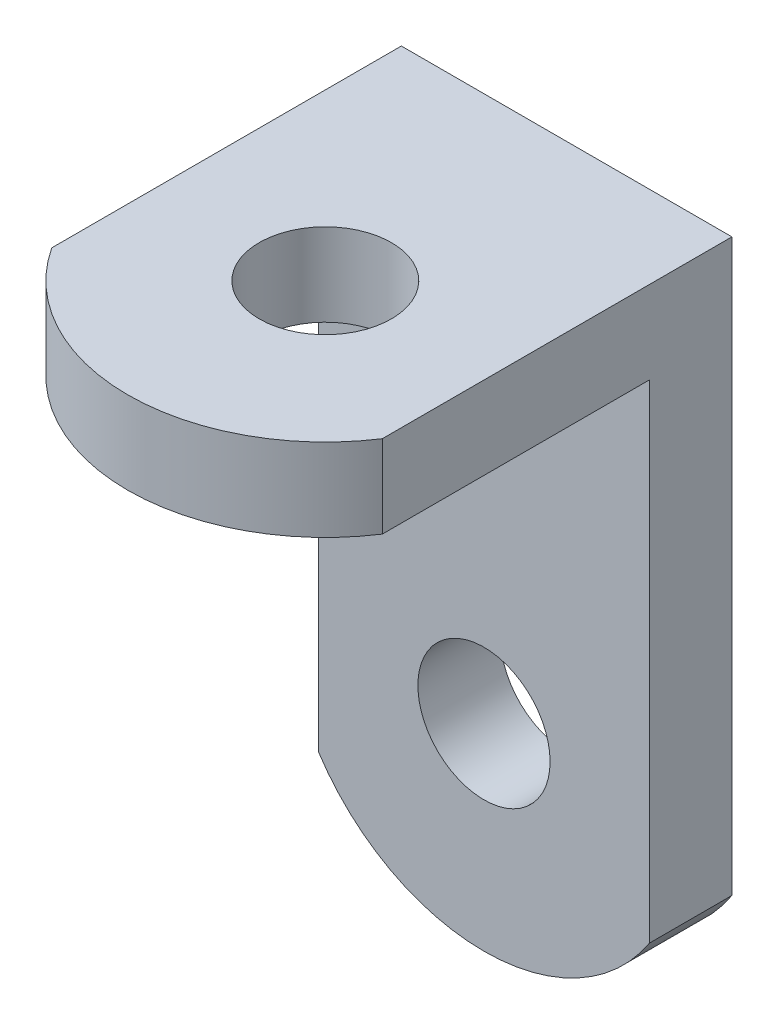
ISO-10303-21;
HEADER;
FILE_DESCRIPTION(('STEP AP214'),'2;1');
FILE_NAME('part.step','',(''),(''),'','','');
FILE_SCHEMA(('AUTOMOTIVE_DESIGN { 1 0 10303 214 1 1 1 1 }'));
ENDSEC;
DATA;
#1=APPLICATION_CONTEXT('core data for automotive mechanical design processes');
#2=APPLICATION_PROTOCOL_DEFINITION('international standard','automotive_design',2000,#1);
#3=PRODUCT_CONTEXT('',#1,'mechanical');
#4=PRODUCT('Part','Part','',(#3));
#5=PRODUCT_RELATED_PRODUCT_CATEGORY('part','',(#4));
#6=PRODUCT_DEFINITION_FORMATION('','',#4);
#7=PRODUCT_DEFINITION_CONTEXT('part definition',#1,'design');
#8=PRODUCT_DEFINITION('design','',#6,#7);
#9=PRODUCT_DEFINITION_SHAPE('','',#8);
#10=(LENGTH_UNIT() NAMED_UNIT(*) SI_UNIT(.MILLI.,.METRE.));
#11=(NAMED_UNIT(*) PLANE_ANGLE_UNIT() SI_UNIT($,.RADIAN.));
#12=(NAMED_UNIT(*) SI_UNIT($,.STERADIAN.) SOLID_ANGLE_UNIT());
#13=UNCERTAINTY_MEASURE_WITH_UNIT(LENGTH_MEASURE(1.E-05),#10,'distance_accuracy_value','');
#14=(GEOMETRIC_REPRESENTATION_CONTEXT(3) GLOBAL_UNCERTAINTY_ASSIGNED_CONTEXT((#13)) GLOBAL_UNIT_ASSIGNED_CONTEXT((#10,
#11,#12)) REPRESENTATION_CONTEXT('',''));
#15=CARTESIAN_POINT('',(0.,0.,0.));
#16=DIRECTION('',(0.,0.,1.));
#17=DIRECTION('',(1.,0.,0.));
#18=AXIS2_PLACEMENT_3D('',#15,#16,#17);
#19=CARTESIAN_POINT('',(-22.7772962881846,3.175,-14.8084731182796));
#20=DIRECTION('',(0.,0.,1.));
#21=DIRECTION('',(1.,0.,0.));
#22=AXIS2_PLACEMENT_3D('',#19,#20,#21);
#23=PLANE('',#22);
#24=CARTESIAN_POINT('',(-16.4272962881846,-14.605,-14.8084731182796));
#25=DIRECTION('',(0.,0.,1.));
#26=DIRECTION('',(1.,0.,0.));
#27=AXIS2_PLACEMENT_3D('',#24,#25,#26);
#28=CIRCLE('',#27,2.54);
#29=CARTESIAN_POINT('',(-13.8872962881846,-14.605,-14.8084731182796));
#30=VERTEX_POINT('',#29);
#31=EDGE_CURVE('E130',#30,#30,#28,.T.);
#32=ORIENTED_EDGE('',*,*,#31,.T.);
#33=EDGE_LOOP('',(#32));
#34=FACE_BOUND('',#33,.T.);
#35=DIRECTION('',(0.,-1.,0.));
#36=VECTOR('',#35,1.);
#37=CARTESIAN_POINT('',(-10.0772962881846,3.175,-14.8084731182796));
#38=LINE('',#37,#36);
#39=CARTESIAN_POINT('',(-10.0772962881846,3.175,-14.8084731182796));
#40=VERTEX_POINT('',#39);
#41=CARTESIAN_POINT('',(-10.0772962881846,-18.7399297242987,-14.8084731182796));
#42=VERTEX_POINT('',#41);
#43=EDGE_CURVE('E11',#40,#42,#38,.T.);
#44=ORIENTED_EDGE('',*,*,#43,.T.);
#45=CARTESIAN_POINT('',(-16.4272962881846,-14.605,-14.8084731182796));
#46=DIRECTION('',(0.,0.,-1.));
#47=DIRECTION('',(1.,0.,0.));
#48=AXIS2_PLACEMENT_3D('',#45,#46,#47);
#49=CIRCLE('',#48,7.57760805431959);
#50=CARTESIAN_POINT('',(-22.7772962881846,-18.7399297242987,-14.8084731182796));
#51=VERTEX_POINT('',#50);
#52=EDGE_CURVE('E138',#42,#51,#49,.T.);
#53=ORIENTED_EDGE('',*,*,#52,.T.);
#54=DIRECTION('',(0.,-1.,0.));
#55=VECTOR('',#54,1.);
#56=CARTESIAN_POINT('',(-22.7772962881846,3.175,-14.8084731182796));
#57=LINE('',#56,#55);
#58=CARTESIAN_POINT('',(-22.7772962881846,3.175,-14.8084731182796));
#59=VERTEX_POINT('',#58);
#60=EDGE_CURVE('E41',#59,#51,#57,.T.);
#61=ORIENTED_EDGE('',*,*,#60,.F.);
#62=DIRECTION('',(-1.,0.,0.));
#63=VECTOR('',#62,1.);
#64=CARTESIAN_POINT('',(-22.7772962881846,3.175,-14.8084731182796));
#65=LINE('',#64,#63);
#66=EDGE_CURVE('E106',#40,#59,#65,.T.);
#67=ORIENTED_EDGE('',*,*,#66,.F.);
#68=EDGE_LOOP('',(#44,#53,#61,#67));
#69=FACE_BOUND('',#68,.T.);
#70=ADVANCED_FACE('F33',(#34,#69),#23,.F.);
#71=CARTESIAN_POINT('',(-10.0772962881846,-22.225,-11.6334731182796));
#72=DIRECTION('',(0.,0.,-1.));
#73=DIRECTION('',(-1.,0.,0.));
#74=AXIS2_PLACEMENT_3D('',#71,#72,#73);
#75=PLANE('',#74);
#76=CARTESIAN_POINT('',(-16.4272962881846,-14.605,-11.6334731182796));
#77=DIRECTION('',(0.,0.,1.));
#78=DIRECTION('',(1.,0.,0.));
#79=AXIS2_PLACEMENT_3D('',#76,#77,#78);
#80=CIRCLE('',#79,2.54);
#81=CARTESIAN_POINT('',(-13.8872962881846,-14.605,-11.6334731182796));
#82=VERTEX_POINT('',#81);
#83=EDGE_CURVE('E131',#82,#82,#80,.T.);
#84=ORIENTED_EDGE('',*,*,#83,.F.);
#85=EDGE_LOOP('',(#84));
#86=FACE_BOUND('',#85,.T.);
#87=DIRECTION('',(0.,1.,0.));
#88=VECTOR('',#87,1.);
#89=CARTESIAN_POINT('',(-22.7772962881846,-22.225,-11.6334731182796));
#90=LINE('',#89,#88);
#91=CARTESIAN_POINT('',(-22.7772962881846,-18.7399297242987,-11.6334731182796));
#92=VERTEX_POINT('',#91);
#93=CARTESIAN_POINT('',(-22.7772962881846,0.,-11.6334731182796));
#94=VERTEX_POINT('',#93);
#95=EDGE_CURVE('E125',#92,#94,#90,.T.);
#96=ORIENTED_EDGE('',*,*,#95,.F.);
#97=CARTESIAN_POINT('',(-16.4272962881846,-14.605,-11.6334731182796));
#98=DIRECTION('',(0.,0.,-1.));
#99=DIRECTION('',(1.,0.,0.));
#100=AXIS2_PLACEMENT_3D('',#97,#98,#99);
#101=CIRCLE('',#100,7.57760805431959);
#102=CARTESIAN_POINT('',(-10.0772962881846,-18.7399297242987,-11.6334731182796));
#103=VERTEX_POINT('',#102);
#104=EDGE_CURVE('E101',#103,#92,#101,.T.);
#105=ORIENTED_EDGE('',*,*,#104,.F.);
#106=DIRECTION('',(0.,1.,0.));
#107=VECTOR('',#106,1.);
#108=CARTESIAN_POINT('',(-10.0772962881846,-22.225,-11.6334731182796));
#109=LINE('',#108,#107);
#110=CARTESIAN_POINT('',(-10.0772962881846,0.,-11.6334731182796));
#111=VERTEX_POINT('',#110);
#112=EDGE_CURVE('E120',#103,#111,#109,.T.);
#113=ORIENTED_EDGE('',*,*,#112,.T.);
#114=DIRECTION('',(-1.,0.,0.));
#115=VECTOR('',#114,1.);
#116=CARTESIAN_POINT('',(-10.0772962881846,0.,-11.6334731182796));
#117=LINE('',#116,#115);
#118=EDGE_CURVE('E127',#111,#94,#117,.T.);
#119=ORIENTED_EDGE('',*,*,#118,.T.);
#120=EDGE_LOOP('',(#96,#105,#113,#119));
#121=FACE_BOUND('',#120,.T.);
#122=ADVANCED_FACE('F154',(#86,#121),#75,.F.);
#123=CARTESIAN_POINT('',(0.,0.,0.));
#124=DIRECTION('',(0.,1.,0.));
#125=DIRECTION('',(0.,0.,1.));
#126=AXIS2_PLACEMENT_3D('',#123,#124,#125);
#127=PLANE('',#126);
#128=CARTESIAN_POINT('',(-16.4272962881846,0.,-5.53747311827957));
#129=DIRECTION('',(0.,1.,0.));
#130=DIRECTION('',(0.,0.,1.));
#131=AXIS2_PLACEMENT_3D('',#128,#129,#130);
#132=CIRCLE('',#131,2.54);
#133=CARTESIAN_POINT('',(-16.4272962881846,0.,-2.99747311827957));
#134=VERTEX_POINT('',#133);
#135=EDGE_CURVE('E115',#134,#134,#132,.T.);
#136=ORIENTED_EDGE('',*,*,#135,.T.);
#137=EDGE_LOOP('',(#136));
#138=FACE_BOUND('',#137,.T.);
#139=DIRECTION('',(0.,0.,-1.));
#140=VECTOR('',#139,1.);
#141=CARTESIAN_POINT('',(-10.0772962881846,0.,-14.8084731182796));
#142=LINE('',#141,#140);
#143=CARTESIAN_POINT('',(-10.0772962881846,0.,-1.37673749706527));
#144=VERTEX_POINT('',#143);
#145=EDGE_CURVE('E113',#144,#111,#142,.T.);
#146=ORIENTED_EDGE('',*,*,#145,.F.);
#147=CARTESIAN_POINT('',(-16.4272962881846,0.,-5.53747311827957));
#148=DIRECTION('',(0.,1.,0.));
#149=DIRECTION('',(0.,0.,-1.));
#150=AXIS2_PLACEMENT_3D('',#147,#148,#149);
#151=CIRCLE('',#150,7.591720550023);
#152=CARTESIAN_POINT('',(-22.7772962881846,0.,-1.37673749706526));
#153=VERTEX_POINT('',#152);
#154=EDGE_CURVE('E91',#153,#144,#151,.T.);
#155=ORIENTED_EDGE('',*,*,#154,.F.);
#156=DIRECTION('',(0.,0.,1.));
#157=VECTOR('',#156,1.);
#158=CARTESIAN_POINT('',(-22.7772962881846,0.,-14.8084731182796));
#159=LINE('',#158,#157);
#160=EDGE_CURVE('E100',#94,#153,#159,.T.);
#161=ORIENTED_EDGE('',*,*,#160,.F.);
#162=ORIENTED_EDGE('',*,*,#118,.F.);
#163=EDGE_LOOP('',(#146,#155,#161,#162));
#164=FACE_BOUND('',#163,.T.);
#165=ADVANCED_FACE('F151',(#138,#164),#127,.F.);
#166=CARTESIAN_POINT('',(-10.0772962881846,3.175,-14.8084731182796));
#167=DIRECTION('',(-1.,0.,0.));
#168=DIRECTION('',(0.,0.,1.));
#169=AXIS2_PLACEMENT_3D('',#166,#167,#168);
#170=PLANE('',#169);
#171=DIRECTION('',(0.,0.,-1.));
#172=VECTOR('',#171,1.);
#173=CARTESIAN_POINT('',(-10.0772962881846,3.175,-14.8084731182796));
#174=LINE('',#173,#172);
#175=CARTESIAN_POINT('',(-10.0772962881846,3.175,-1.37673749706527));
#176=VERTEX_POINT('',#175);
#177=EDGE_CURVE('E109',#176,#40,#174,.T.);
#178=ORIENTED_EDGE('',*,*,#177,.F.);
#179=DIRECTION('',(0.,-1.,0.));
#180=VECTOR('',#179,1.);
#181=CARTESIAN_POINT('',(-10.0772962881846,3.175,-1.37673749706527));
#182=LINE('',#181,#180);
#183=EDGE_CURVE('E48',#176,#144,#182,.T.);
#184=ORIENTED_EDGE('',*,*,#183,.T.);
#185=ORIENTED_EDGE('',*,*,#145,.T.);
#186=ORIENTED_EDGE('',*,*,#112,.F.);
#187=DIRECTION('',(0.,0.,1.));
#188=VECTOR('',#187,1.);
#189=CARTESIAN_POINT('',(-10.0772962881846,-18.7399297242987,-14.8084731182796));
#190=LINE('',#189,#188);
#191=EDGE_CURVE('E56',#42,#103,#190,.T.);
#192=ORIENTED_EDGE('',*,*,#191,.F.);
#193=ORIENTED_EDGE('',*,*,#43,.F.);
#194=EDGE_LOOP('',(#178,#184,#185,#186,#192,#193));
#195=FACE_BOUND('',#194,.T.);
#196=ADVANCED_FACE('F35',(#195),#170,.F.);
#197=CARTESIAN_POINT('',(-22.7772962881846,3.175,-14.8084731182796));
#198=DIRECTION('',(1.,0.,0.));
#199=DIRECTION('',(0.,0.,-1.));
#200=AXIS2_PLACEMENT_3D('',#197,#198,#199);
#201=PLANE('',#200);
#202=ORIENTED_EDGE('',*,*,#160,.T.);
#203=DIRECTION('',(0.,-1.,0.));
#204=VECTOR('',#203,1.);
#205=CARTESIAN_POINT('',(-22.7772962881846,3.175,-1.37673749706526));
#206=LINE('',#205,#204);
#207=CARTESIAN_POINT('',(-22.7772962881846,3.175,-1.37673749706526));
#208=VERTEX_POINT('',#207);
#209=EDGE_CURVE('E86',#208,#153,#206,.T.);
#210=ORIENTED_EDGE('',*,*,#209,.F.);
#211=DIRECTION('',(0.,0.,1.));
#212=VECTOR('',#211,1.);
#213=CARTESIAN_POINT('',(-22.7772962881846,3.175,-14.8084731182796));
#214=LINE('',#213,#212);
#215=EDGE_CURVE('E98',#59,#208,#214,.T.);
#216=ORIENTED_EDGE('',*,*,#215,.F.);
#217=ORIENTED_EDGE('',*,*,#60,.T.);
#218=DIRECTION('',(0.,0.,1.));
#219=VECTOR('',#218,1.);
#220=CARTESIAN_POINT('',(-22.7772962881846,-18.7399297242987,-14.8084731182796));
#221=LINE('',#220,#219);
#222=EDGE_CURVE('E134',#51,#92,#221,.T.);
#223=ORIENTED_EDGE('',*,*,#222,.T.);
#224=ORIENTED_EDGE('',*,*,#95,.T.);
#225=EDGE_LOOP('',(#202,#210,#216,#217,#223,#224));
#226=FACE_BOUND('',#225,.T.);
#227=ADVANCED_FACE('F96',(#226),#201,.F.);
#228=CARTESIAN_POINT('',(0.,3.175,0.));
#229=DIRECTION('',(0.,1.,0.));
#230=DIRECTION('',(0.,0.,1.));
#231=AXIS2_PLACEMENT_3D('',#228,#229,#230);
#232=PLANE('',#231);
#233=CARTESIAN_POINT('',(-16.4272962881846,3.175,-5.53747311827957));
#234=DIRECTION('',(0.,1.,0.));
#235=DIRECTION('',(0.,0.,-1.));
#236=AXIS2_PLACEMENT_3D('',#233,#234,#235);
#237=CIRCLE('',#236,7.591720550023);
#238=EDGE_CURVE('E83',#208,#176,#237,.T.);
#239=ORIENTED_EDGE('',*,*,#238,.T.);
#240=ORIENTED_EDGE('',*,*,#177,.T.);
#241=ORIENTED_EDGE('',*,*,#66,.T.);
#242=ORIENTED_EDGE('',*,*,#215,.T.);
#243=EDGE_LOOP('',(#239,#240,#241,#242));
#244=FACE_BOUND('',#243,.T.);
#245=CARTESIAN_POINT('',(-16.4272962881846,3.175,-5.53747311827957));
#246=DIRECTION('',(0.,1.,0.));
#247=DIRECTION('',(0.,0.,1.));
#248=AXIS2_PLACEMENT_3D('',#245,#246,#247);
#249=CIRCLE('',#248,2.54);
#250=CARTESIAN_POINT('',(-16.4272962881846,3.175,-2.99747311827957));
#251=VERTEX_POINT('',#250);
#252=EDGE_CURVE('E117',#251,#251,#249,.T.);
#253=ORIENTED_EDGE('',*,*,#252,.F.);
#254=EDGE_LOOP('',(#253));
#255=FACE_BOUND('',#254,.T.);
#256=ADVANCED_FACE('F103',(#244,#255),#232,.T.);
#257=CARTESIAN_POINT('',(-16.4272962881846,0.,-5.53747311827957));
#258=DIRECTION('',(0.,1.,0.));
#259=DIRECTION('',(0.,0.,1.));
#260=AXIS2_PLACEMENT_3D('',#257,#258,#259);
#261=CYLINDRICAL_SURFACE('',#260,2.54);
#262=ORIENTED_EDGE('',*,*,#135,.F.);
#263=EDGE_LOOP('',(#262));
#264=FACE_BOUND('',#263,.T.);
#265=ORIENTED_EDGE('',*,*,#252,.T.);
#266=EDGE_LOOP('',(#265));
#267=FACE_BOUND('',#266,.T.);
#268=ADVANCED_FACE('F165',(#264,#267),#261,.F.);
#269=CARTESIAN_POINT('',(-16.4272962881846,-14.605,-14.8084731182796));
#270=DIRECTION('',(0.,0.,1.));
#271=DIRECTION('',(1.,0.,0.));
#272=AXIS2_PLACEMENT_3D('',#269,#270,#271);
#273=CYLINDRICAL_SURFACE('',#272,2.54);
#274=ORIENTED_EDGE('',*,*,#31,.F.);
#275=EDGE_LOOP('',(#274));
#276=FACE_BOUND('',#275,.T.);
#277=ORIENTED_EDGE('',*,*,#83,.T.);
#278=EDGE_LOOP('',(#277));
#279=FACE_BOUND('',#278,.T.);
#280=ADVANCED_FACE('F158',(#276,#279),#273,.F.);
#281=CARTESIAN_POINT('',(-16.4272962881846,-14.605,-14.8084731182796));
#282=DIRECTION('',(0.,0.,1.));
#283=DIRECTION('',(1.,0.,0.));
#284=AXIS2_PLACEMENT_3D('',#281,#282,#283);
#285=CYLINDRICAL_SURFACE('',#284,7.57760805431959);
#286=ORIENTED_EDGE('',*,*,#104,.T.);
#287=ORIENTED_EDGE('',*,*,#222,.F.);
#288=ORIENTED_EDGE('',*,*,#52,.F.);
#289=ORIENTED_EDGE('',*,*,#191,.T.);
#290=EDGE_LOOP('',(#286,#287,#288,#289));
#291=FACE_BOUND('',#290,.T.);
#292=ADVANCED_FACE('F156',(#291),#285,.T.);
#293=CARTESIAN_POINT('',(-16.4272962881846,3.175,-5.53747311827957));
#294=DIRECTION('',(0.,-1.,0.));
#295=DIRECTION('',(0.,0.,-1.));
#296=AXIS2_PLACEMENT_3D('',#293,#294,#295);
#297=CYLINDRICAL_SURFACE('',#296,7.591720550023);
#298=ORIENTED_EDGE('',*,*,#154,.T.);
#299=ORIENTED_EDGE('',*,*,#183,.F.);
#300=ORIENTED_EDGE('',*,*,#238,.F.);
#301=ORIENTED_EDGE('',*,*,#209,.T.);
#302=EDGE_LOOP('',(#298,#299,#300,#301));
#303=FACE_BOUND('',#302,.T.);
#304=ADVANCED_FACE('F85',(#303),#297,.T.);
#305=CLOSED_SHELL('',(#70,#122,#165,#196,#227,#256,#268,#280,#292,#304));
#306=MANIFOLD_SOLID_BREP('B2',#305);
#307=ADVANCED_BREP_SHAPE_REPRESENTATION('',(#18,#306),#14);
#308=SHAPE_DEFINITION_REPRESENTATION(#9,#307);
ENDSEC;
END-ISO-10303-21;
